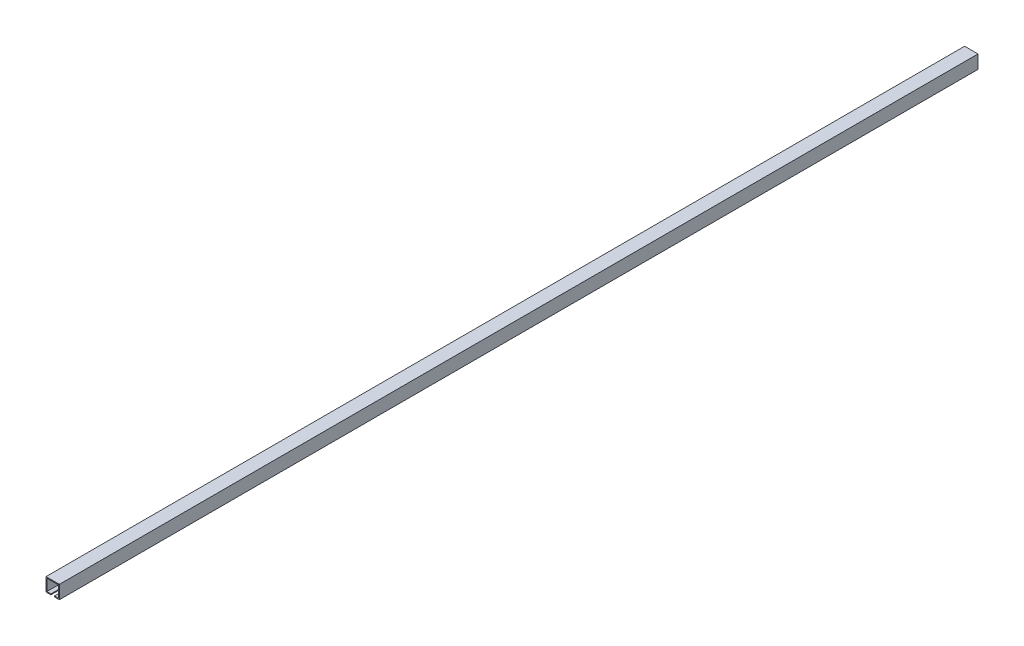
ISO-10303-21;
HEADER;
FILE_DESCRIPTION(('STEP AP214'),'2;1');
FILE_NAME('part.step','',(''),(''),'','','');
FILE_SCHEMA(('AUTOMOTIVE_DESIGN { 1 0 10303 214 1 1 1 1 }'));
ENDSEC;
DATA;
#1=APPLICATION_CONTEXT('core data for automotive mechanical design processes');
#2=APPLICATION_PROTOCOL_DEFINITION('international standard','automotive_design',2000,#1);
#3=PRODUCT_CONTEXT('',#1,'mechanical');
#4=PRODUCT('Part','Part','',(#3));
#5=PRODUCT_RELATED_PRODUCT_CATEGORY('part','',(#4));
#6=PRODUCT_DEFINITION_FORMATION('','',#4);
#7=PRODUCT_DEFINITION_CONTEXT('part definition',#1,'design');
#8=PRODUCT_DEFINITION('design','',#6,#7);
#9=PRODUCT_DEFINITION_SHAPE('','',#8);
#10=(LENGTH_UNIT() NAMED_UNIT(*) SI_UNIT(.MILLI.,.METRE.));
#11=(NAMED_UNIT(*) PLANE_ANGLE_UNIT() SI_UNIT($,.RADIAN.));
#12=(NAMED_UNIT(*) SI_UNIT($,.STERADIAN.) SOLID_ANGLE_UNIT());
#13=UNCERTAINTY_MEASURE_WITH_UNIT(LENGTH_MEASURE(1.E-05),#10,'distance_accuracy_value','');
#14=(GEOMETRIC_REPRESENTATION_CONTEXT(3) GLOBAL_UNCERTAINTY_ASSIGNED_CONTEXT((#13)) GLOBAL_UNIT_ASSIGNED_CONTEXT((#10,
#11,#12)) REPRESENTATION_CONTEXT('',''));
#15=CARTESIAN_POINT('',(0.,0.,0.));
#16=DIRECTION('',(0.,0.,1.));
#17=DIRECTION('',(1.,0.,0.));
#18=AXIS2_PLACEMENT_3D('',#15,#16,#17);
#19=CARTESIAN_POINT('',(-13.,-13.,1030.));
#20=DIRECTION('',(0.,-1.,0.));
#21=DIRECTION('',(0.,0.,-1.));
#22=AXIS2_PLACEMENT_3D('',#19,#20,#21);
#23=PLANE('',#22);
#24=DIRECTION('',(-1.,0.,0.));
#25=VECTOR('',#24,1.);
#26=CARTESIAN_POINT('',(-13.,-13.,-1030.));
#27=LINE('',#26,#25);
#28=CARTESIAN_POINT('',(-4.,-13.,-1030.));
#29=VERTEX_POINT('',#28);
#30=CARTESIAN_POINT('',(-13.,-13.,-1030.));
#31=VERTEX_POINT('',#30);
#32=EDGE_CURVE('E164',#29,#31,#27,.T.);
#33=ORIENTED_EDGE('',*,*,#32,.T.);
#34=DIRECTION('',(0.,0.,-1.));
#35=VECTOR('',#34,1.);
#36=CARTESIAN_POINT('',(-13.,-13.,1030.));
#37=LINE('',#36,#35);
#38=CARTESIAN_POINT('',(-13.,-13.,1030.));
#39=VERTEX_POINT('',#38);
#40=EDGE_CURVE('E11',#39,#31,#37,.T.);
#41=ORIENTED_EDGE('',*,*,#40,.F.);
#42=DIRECTION('',(-1.,0.,0.));
#43=VECTOR('',#42,1.);
#44=CARTESIAN_POINT('',(-13.,-13.,1030.));
#45=LINE('',#44,#43);
#46=CARTESIAN_POINT('',(-4.,-13.,1030.));
#47=VERTEX_POINT('',#46);
#48=EDGE_CURVE('E198',#47,#39,#45,.T.);
#49=ORIENTED_EDGE('',*,*,#48,.F.);
#50=DIRECTION('',(0.,0.,-1.));
#51=VECTOR('',#50,1.);
#52=CARTESIAN_POINT('',(-4.,-13.,1030.));
#53=LINE('',#52,#51);
#54=EDGE_CURVE('E160',#47,#29,#53,.T.);
#55=ORIENTED_EDGE('',*,*,#54,.T.);
#56=EDGE_LOOP('',(#33,#41,#49,#55));
#57=FACE_BOUND('',#56,.T.);
#58=ADVANCED_FACE('F39',(#57),#23,.F.);
#59=CARTESIAN_POINT('',(-13.,13.,1030.));
#60=DIRECTION('',(-1.,0.,0.));
#61=DIRECTION('',(0.,0.,1.));
#62=AXIS2_PLACEMENT_3D('',#59,#60,#61);
#63=PLANE('',#62);
#64=DIRECTION('',(0.,1.,0.));
#65=VECTOR('',#64,1.);
#66=CARTESIAN_POINT('',(-13.,13.,-1030.));
#67=LINE('',#66,#65);
#68=CARTESIAN_POINT('',(-13.,13.,-1030.));
#69=VERTEX_POINT('',#68);
#70=EDGE_CURVE('E168',#31,#69,#67,.T.);
#71=ORIENTED_EDGE('',*,*,#70,.T.);
#72=DIRECTION('',(0.,0.,-1.));
#73=VECTOR('',#72,1.);
#74=CARTESIAN_POINT('',(-13.,13.,1030.));
#75=LINE('',#74,#73);
#76=CARTESIAN_POINT('',(-13.,13.,1030.));
#77=VERTEX_POINT('',#76);
#78=EDGE_CURVE('E48',#77,#69,#75,.T.);
#79=ORIENTED_EDGE('',*,*,#78,.F.);
#80=DIRECTION('',(0.,1.,0.));
#81=VECTOR('',#80,1.);
#82=CARTESIAN_POINT('',(-13.,13.,1030.));
#83=LINE('',#82,#81);
#84=EDGE_CURVE('E111',#39,#77,#83,.T.);
#85=ORIENTED_EDGE('',*,*,#84,.F.);
#86=ORIENTED_EDGE('',*,*,#40,.T.);
#87=EDGE_LOOP('',(#71,#79,#85,#86));
#88=FACE_BOUND('',#87,.T.);
#89=ADVANCED_FACE('F292',(#88),#63,.F.);
#90=CARTESIAN_POINT('',(13.,13.,1030.));
#91=DIRECTION('',(0.,1.,0.));
#92=DIRECTION('',(0.,0.,1.));
#93=AXIS2_PLACEMENT_3D('',#90,#91,#92);
#94=PLANE('',#93);
#95=DIRECTION('',(1.,0.,0.));
#96=VECTOR('',#95,1.);
#97=CARTESIAN_POINT('',(13.,13.,-1030.));
#98=LINE('',#97,#96);
#99=CARTESIAN_POINT('',(13.,13.,-1030.));
#100=VERTEX_POINT('',#99);
#101=EDGE_CURVE('E171',#69,#100,#98,.T.);
#102=ORIENTED_EDGE('',*,*,#101,.T.);
#103=DIRECTION('',(0.,0.,-1.));
#104=VECTOR('',#103,1.);
#105=CARTESIAN_POINT('',(13.,13.,1030.));
#106=LINE('',#105,#104);
#107=CARTESIAN_POINT('',(13.,13.,1030.));
#108=VERTEX_POINT('',#107);
#109=EDGE_CURVE('E225',#108,#100,#106,.T.);
#110=ORIENTED_EDGE('',*,*,#109,.F.);
#111=DIRECTION('',(1.,0.,0.));
#112=VECTOR('',#111,1.);
#113=CARTESIAN_POINT('',(13.,13.,1030.));
#114=LINE('',#113,#112);
#115=EDGE_CURVE('E235',#77,#108,#114,.T.);
#116=ORIENTED_EDGE('',*,*,#115,.F.);
#117=ORIENTED_EDGE('',*,*,#78,.T.);
#118=EDGE_LOOP('',(#102,#110,#116,#117));
#119=FACE_BOUND('',#118,.T.);
#120=ADVANCED_FACE('F233',(#119),#94,.F.);
#121=CARTESIAN_POINT('',(13.,-13.,1030.));
#122=DIRECTION('',(1.,0.,0.));
#123=DIRECTION('',(0.,0.,-1.));
#124=AXIS2_PLACEMENT_3D('',#121,#122,#123);
#125=PLANE('',#124);
#126=DIRECTION('',(0.,-1.,0.));
#127=VECTOR('',#126,1.);
#128=CARTESIAN_POINT('',(13.,-13.,-1030.));
#129=LINE('',#128,#127);
#130=CARTESIAN_POINT('',(13.,-13.,-1030.));
#131=VERTEX_POINT('',#130);
#132=EDGE_CURVE('E174',#100,#131,#129,.T.);
#133=ORIENTED_EDGE('',*,*,#132,.T.);
#134=DIRECTION('',(0.,0.,-1.));
#135=VECTOR('',#134,1.);
#136=CARTESIAN_POINT('',(13.,-13.,1030.));
#137=LINE('',#136,#135);
#138=CARTESIAN_POINT('',(13.,-13.,1030.));
#139=VERTEX_POINT('',#138);
#140=EDGE_CURVE('E221',#139,#131,#137,.T.);
#141=ORIENTED_EDGE('',*,*,#140,.F.);
#142=DIRECTION('',(0.,-1.,0.));
#143=VECTOR('',#142,1.);
#144=CARTESIAN_POINT('',(13.,-13.,1030.));
#145=LINE('',#144,#143);
#146=EDGE_CURVE('E254',#108,#139,#145,.T.);
#147=ORIENTED_EDGE('',*,*,#146,.F.);
#148=ORIENTED_EDGE('',*,*,#109,.T.);
#149=EDGE_LOOP('',(#133,#141,#147,#148));
#150=FACE_BOUND('',#149,.T.);
#151=ADVANCED_FACE('F244',(#150),#125,.F.);
#152=CARTESIAN_POINT('',(4.,-13.,1030.));
#153=DIRECTION('',(0.,-1.,0.));
#154=DIRECTION('',(0.,0.,-1.));
#155=AXIS2_PLACEMENT_3D('',#152,#153,#154);
#156=PLANE('',#155);
#157=DIRECTION('',(-1.,0.,0.));
#158=VECTOR('',#157,1.);
#159=CARTESIAN_POINT('',(4.,-13.,-1030.));
#160=LINE('',#159,#158);
#161=CARTESIAN_POINT('',(4.,-13.,-1030.));
#162=VERTEX_POINT('',#161);
#163=EDGE_CURVE('E177',#131,#162,#160,.T.);
#164=ORIENTED_EDGE('',*,*,#163,.T.);
#165=DIRECTION('',(0.,0.,-1.));
#166=VECTOR('',#165,1.);
#167=CARTESIAN_POINT('',(4.,-13.,1030.));
#168=LINE('',#167,#166);
#169=CARTESIAN_POINT('',(4.,-13.,1030.));
#170=VERTEX_POINT('',#169);
#171=EDGE_CURVE('E217',#170,#162,#168,.T.);
#172=ORIENTED_EDGE('',*,*,#171,.F.);
#173=DIRECTION('',(-1.,0.,0.));
#174=VECTOR('',#173,1.);
#175=CARTESIAN_POINT('',(4.,-13.,1030.));
#176=LINE('',#175,#174);
#177=EDGE_CURVE('E250',#139,#170,#176,.T.);
#178=ORIENTED_EDGE('',*,*,#177,.F.);
#179=ORIENTED_EDGE('',*,*,#140,.T.);
#180=EDGE_LOOP('',(#164,#172,#178,#179));
#181=FACE_BOUND('',#180,.T.);
#182=ADVANCED_FACE('F248',(#181),#156,.F.);
#183=CARTESIAN_POINT('',(3.99999999999999,-15.,1030.));
#184=DIRECTION('',(1.,0.,0.));
#185=DIRECTION('',(0.,1.,0.));
#186=AXIS2_PLACEMENT_3D('',#183,#184,#185);
#187=PLANE('',#186);
#188=DIRECTION('',(0.,-1.,0.));
#189=VECTOR('',#188,1.);
#190=CARTESIAN_POINT('',(3.99999999999999,-15.,-1030.));
#191=LINE('',#190,#189);
#192=CARTESIAN_POINT('',(3.99999999999999,-15.,-1030.));
#193=VERTEX_POINT('',#192);
#194=EDGE_CURVE('E180',#162,#193,#191,.T.);
#195=ORIENTED_EDGE('',*,*,#194,.T.);
#196=DIRECTION('',(0.,0.,-1.));
#197=VECTOR('',#196,1.);
#198=CARTESIAN_POINT('',(3.99999999999999,-15.,1030.));
#199=LINE('',#198,#197);
#200=CARTESIAN_POINT('',(3.99999999999999,-15.,1030.));
#201=VERTEX_POINT('',#200);
#202=EDGE_CURVE('E213',#201,#193,#199,.T.);
#203=ORIENTED_EDGE('',*,*,#202,.F.);
#204=DIRECTION('',(0.,-1.,0.));
#205=VECTOR('',#204,1.);
#206=CARTESIAN_POINT('',(3.99999999999999,-15.,1030.));
#207=LINE('',#206,#205);
#208=EDGE_CURVE('E253',#170,#201,#207,.T.);
#209=ORIENTED_EDGE('',*,*,#208,.F.);
#210=ORIENTED_EDGE('',*,*,#171,.T.);
#211=EDGE_LOOP('',(#195,#203,#209,#210));
#212=FACE_BOUND('',#211,.T.);
#213=ADVANCED_FACE('F305',(#212),#187,.F.);
#214=CARTESIAN_POINT('',(15.,-15.,1030.));
#215=DIRECTION('',(0.,1.,0.));
#216=DIRECTION('',(-1.,0.,0.));
#217=AXIS2_PLACEMENT_3D('',#214,#215,#216);
#218=PLANE('',#217);
#219=DIRECTION('',(1.,0.,0.));
#220=VECTOR('',#219,1.);
#221=CARTESIAN_POINT('',(15.,-15.,-1030.));
#222=LINE('',#221,#220);
#223=CARTESIAN_POINT('',(15.,-15.,-1030.));
#224=VERTEX_POINT('',#223);
#225=EDGE_CURVE('E183',#193,#224,#222,.T.);
#226=ORIENTED_EDGE('',*,*,#225,.T.);
#227=DIRECTION('',(0.,0.,-1.));
#228=VECTOR('',#227,1.);
#229=CARTESIAN_POINT('',(15.,-15.,1030.));
#230=LINE('',#229,#228);
#231=CARTESIAN_POINT('',(15.,-15.,1030.));
#232=VERTEX_POINT('',#231);
#233=EDGE_CURVE('E209',#232,#224,#230,.T.);
#234=ORIENTED_EDGE('',*,*,#233,.F.);
#235=DIRECTION('',(1.,0.,0.));
#236=VECTOR('',#235,1.);
#237=CARTESIAN_POINT('',(15.,-15.,1030.));
#238=LINE('',#237,#236);
#239=EDGE_CURVE('E258',#201,#232,#238,.T.);
#240=ORIENTED_EDGE('',*,*,#239,.F.);
#241=ORIENTED_EDGE('',*,*,#202,.T.);
#242=EDGE_LOOP('',(#226,#234,#240,#241));
#243=FACE_BOUND('',#242,.T.);
#244=ADVANCED_FACE('F308',(#243),#218,.F.);
#245=CARTESIAN_POINT('',(15.,15.,1030.));
#246=DIRECTION('',(-1.,0.,0.));
#247=DIRECTION('',(0.,-1.,0.));
#248=AXIS2_PLACEMENT_3D('',#245,#246,#247);
#249=PLANE('',#248);
#250=DIRECTION('',(0.,1.,0.));
#251=VECTOR('',#250,1.);
#252=CARTESIAN_POINT('',(15.,15.,-1030.));
#253=LINE('',#252,#251);
#254=CARTESIAN_POINT('',(15.,15.,-1030.));
#255=VERTEX_POINT('',#254);
#256=EDGE_CURVE('E186',#224,#255,#253,.T.);
#257=ORIENTED_EDGE('',*,*,#256,.T.);
#258=DIRECTION('',(0.,0.,-1.));
#259=VECTOR('',#258,1.);
#260=CARTESIAN_POINT('',(15.,15.,1030.));
#261=LINE('',#260,#259);
#262=CARTESIAN_POINT('',(15.,15.,1030.));
#263=VERTEX_POINT('',#262);
#264=EDGE_CURVE('E205',#263,#255,#261,.T.);
#265=ORIENTED_EDGE('',*,*,#264,.F.);
#266=DIRECTION('',(0.,1.,0.));
#267=VECTOR('',#266,1.);
#268=CARTESIAN_POINT('',(15.,15.,1030.));
#269=LINE('',#268,#267);
#270=EDGE_CURVE('E265',#232,#263,#269,.T.);
#271=ORIENTED_EDGE('',*,*,#270,.F.);
#272=ORIENTED_EDGE('',*,*,#233,.T.);
#273=EDGE_LOOP('',(#257,#265,#271,#272));
#274=FACE_BOUND('',#273,.T.);
#275=ADVANCED_FACE('F273',(#274),#249,.F.);
#276=CARTESIAN_POINT('',(-15.,15.,1030.));
#277=DIRECTION('',(0.,-1.,0.));
#278=DIRECTION('',(0.,0.,-1.));
#279=AXIS2_PLACEMENT_3D('',#276,#277,#278);
#280=PLANE('',#279);
#281=DIRECTION('',(-1.,0.,0.));
#282=VECTOR('',#281,1.);
#283=CARTESIAN_POINT('',(-15.,15.,-1030.));
#284=LINE('',#283,#282);
#285=CARTESIAN_POINT('',(-15.,15.,-1030.));
#286=VERTEX_POINT('',#285);
#287=EDGE_CURVE('E189',#255,#286,#284,.T.);
#288=ORIENTED_EDGE('',*,*,#287,.T.);
#289=DIRECTION('',(0.,0.,-1.));
#290=VECTOR('',#289,1.);
#291=CARTESIAN_POINT('',(-15.,15.,1030.));
#292=LINE('',#291,#290);
#293=CARTESIAN_POINT('',(-15.,15.,1030.));
#294=VERTEX_POINT('',#293);
#295=EDGE_CURVE('E153',#294,#286,#292,.T.);
#296=ORIENTED_EDGE('',*,*,#295,.F.);
#297=DIRECTION('',(-1.,0.,0.));
#298=VECTOR('',#297,1.);
#299=CARTESIAN_POINT('',(-15.,15.,1030.));
#300=LINE('',#299,#298);
#301=EDGE_CURVE('E142',#263,#294,#300,.T.);
#302=ORIENTED_EDGE('',*,*,#301,.F.);
#303=ORIENTED_EDGE('',*,*,#264,.T.);
#304=EDGE_LOOP('',(#288,#296,#302,#303));
#305=FACE_BOUND('',#304,.T.);
#306=ADVANCED_FACE('F277',(#305),#280,.F.);
#307=CARTESIAN_POINT('',(-15.,-15.,1030.));
#308=DIRECTION('',(1.,0.,0.));
#309=DIRECTION('',(0.,1.,0.));
#310=AXIS2_PLACEMENT_3D('',#307,#308,#309);
#311=PLANE('',#310);
#312=DIRECTION('',(0.,-1.,0.));
#313=VECTOR('',#312,1.);
#314=CARTESIAN_POINT('',(-15.,-15.,-1030.));
#315=LINE('',#314,#313);
#316=CARTESIAN_POINT('',(-15.,-15.,-1030.));
#317=VERTEX_POINT('',#316);
#318=EDGE_CURVE('E151',#286,#317,#315,.T.);
#319=ORIENTED_EDGE('',*,*,#318,.T.);
#320=DIRECTION('',(0.,0.,-1.));
#321=VECTOR('',#320,1.);
#322=CARTESIAN_POINT('',(-15.,-15.,1030.));
#323=LINE('',#322,#321);
#324=CARTESIAN_POINT('',(-15.,-15.,1030.));
#325=VERTEX_POINT('',#324);
#326=EDGE_CURVE('E148',#325,#317,#323,.T.);
#327=ORIENTED_EDGE('',*,*,#326,.F.);
#328=DIRECTION('',(0.,-1.,0.));
#329=VECTOR('',#328,1.);
#330=CARTESIAN_POINT('',(-15.,-15.,1030.));
#331=LINE('',#330,#329);
#332=EDGE_CURVE('E136',#294,#325,#331,.T.);
#333=ORIENTED_EDGE('',*,*,#332,.F.);
#334=ORIENTED_EDGE('',*,*,#295,.T.);
#335=EDGE_LOOP('',(#319,#327,#333,#334));
#336=FACE_BOUND('',#335,.T.);
#337=ADVANCED_FACE('F149',(#336),#311,.F.);
#338=CARTESIAN_POINT('',(-3.99999999999999,-15.,1030.));
#339=DIRECTION('',(0.,1.,0.));
#340=DIRECTION('',(0.,0.,1.));
#341=AXIS2_PLACEMENT_3D('',#338,#339,#340);
#342=PLANE('',#341);
#343=DIRECTION('',(1.,0.,0.));
#344=VECTOR('',#343,1.);
#345=CARTESIAN_POINT('',(-3.99999999999999,-15.,-1030.));
#346=LINE('',#345,#344);
#347=CARTESIAN_POINT('',(-3.99999999999999,-15.,-1030.));
#348=VERTEX_POINT('',#347);
#349=EDGE_CURVE('E97',#317,#348,#346,.T.);
#350=ORIENTED_EDGE('',*,*,#349,.T.);
#351=DIRECTION('',(0.,0.,-1.));
#352=VECTOR('',#351,1.);
#353=CARTESIAN_POINT('',(-3.99999999999999,-15.,1030.));
#354=LINE('',#353,#352);
#355=CARTESIAN_POINT('',(-3.99999999999999,-15.,1030.));
#356=VERTEX_POINT('',#355);
#357=EDGE_CURVE('E154',#356,#348,#354,.T.);
#358=ORIENTED_EDGE('',*,*,#357,.F.);
#359=DIRECTION('',(1.,0.,0.));
#360=VECTOR('',#359,1.);
#361=CARTESIAN_POINT('',(-3.99999999999999,-15.,1030.));
#362=LINE('',#361,#360);
#363=EDGE_CURVE('E140',#325,#356,#362,.T.);
#364=ORIENTED_EDGE('',*,*,#363,.F.);
#365=ORIENTED_EDGE('',*,*,#326,.T.);
#366=EDGE_LOOP('',(#350,#358,#364,#365));
#367=FACE_BOUND('',#366,.T.);
#368=ADVANCED_FACE('F156',(#367),#342,.F.);
#369=CARTESIAN_POINT('',(-4.,-13.,1030.));
#370=DIRECTION('',(-1.,0.,0.));
#371=DIRECTION('',(0.,-1.,0.));
#372=AXIS2_PLACEMENT_3D('',#369,#370,#371);
#373=PLANE('',#372);
#374=DIRECTION('',(0.,1.,0.));
#375=VECTOR('',#374,1.);
#376=CARTESIAN_POINT('',(-4.,-13.,-1030.));
#377=LINE('',#376,#375);
#378=EDGE_CURVE('E103',#348,#29,#377,.T.);
#379=ORIENTED_EDGE('',*,*,#378,.T.);
#380=ORIENTED_EDGE('',*,*,#54,.F.);
#381=DIRECTION('',(0.,1.,0.));
#382=VECTOR('',#381,1.);
#383=CARTESIAN_POINT('',(-4.,-13.,1030.));
#384=LINE('',#383,#382);
#385=EDGE_CURVE('E56',#356,#47,#384,.T.);
#386=ORIENTED_EDGE('',*,*,#385,.F.);
#387=ORIENTED_EDGE('',*,*,#357,.T.);
#388=EDGE_LOOP('',(#379,#380,#386,#387));
#389=FACE_BOUND('',#388,.T.);
#390=ADVANCED_FACE('F281',(#389),#373,.F.);
#391=CARTESIAN_POINT('',(0.,0.,1030.));
#392=DIRECTION('',(0.,0.,-1.));
#393=DIRECTION('',(-1.,0.,0.));
#394=AXIS2_PLACEMENT_3D('',#391,#392,#393);
#395=PLANE('',#394);
#396=ORIENTED_EDGE('',*,*,#48,.T.);
#397=ORIENTED_EDGE('',*,*,#84,.T.);
#398=ORIENTED_EDGE('',*,*,#115,.T.);
#399=ORIENTED_EDGE('',*,*,#146,.T.);
#400=ORIENTED_EDGE('',*,*,#177,.T.);
#401=ORIENTED_EDGE('',*,*,#208,.T.);
#402=ORIENTED_EDGE('',*,*,#239,.T.);
#403=ORIENTED_EDGE('',*,*,#270,.T.);
#404=ORIENTED_EDGE('',*,*,#301,.T.);
#405=ORIENTED_EDGE('',*,*,#332,.T.);
#406=ORIENTED_EDGE('',*,*,#363,.T.);
#407=ORIENTED_EDGE('',*,*,#385,.T.);
#408=EDGE_LOOP('',(#396,#397,#398,#399,#400,#401,#402,#403,#404,#405,#406,#407));
#409=FACE_BOUND('',#408,.T.);
#410=ADVANCED_FACE('F138',(#409),#395,.F.);
#411=CARTESIAN_POINT('',(0.,0.,-1030.));
#412=DIRECTION('',(0.,0.,-1.));
#413=DIRECTION('',(-1.,0.,0.));
#414=AXIS2_PLACEMENT_3D('',#411,#412,#413);
#415=PLANE('',#414);
#416=ORIENTED_EDGE('',*,*,#32,.F.);
#417=ORIENTED_EDGE('',*,*,#378,.F.);
#418=ORIENTED_EDGE('',*,*,#349,.F.);
#419=ORIENTED_EDGE('',*,*,#318,.F.);
#420=ORIENTED_EDGE('',*,*,#287,.F.);
#421=ORIENTED_EDGE('',*,*,#256,.F.);
#422=ORIENTED_EDGE('',*,*,#225,.F.);
#423=ORIENTED_EDGE('',*,*,#194,.F.);
#424=ORIENTED_EDGE('',*,*,#163,.F.);
#425=ORIENTED_EDGE('',*,*,#132,.F.);
#426=ORIENTED_EDGE('',*,*,#101,.F.);
#427=ORIENTED_EDGE('',*,*,#70,.F.);
#428=EDGE_LOOP('',(#416,#417,#418,#419,#420,#421,#422,#423,#424,#425,#426,#427));
#429=FACE_BOUND('',#428,.T.);
#430=ADVANCED_FACE('F239',(#429),#415,.T.);
#431=CLOSED_SHELL('',(#58,#89,#120,#151,#182,#213,#244,#275,#306,#337,#368,#390,#410,#430));
#432=MANIFOLD_SOLID_BREP('B2',#431);
#433=ADVANCED_BREP_SHAPE_REPRESENTATION('',(#18,#432),#14);
#434=SHAPE_DEFINITION_REPRESENTATION(#9,#433);
ENDSEC;
END-ISO-10303-21;
